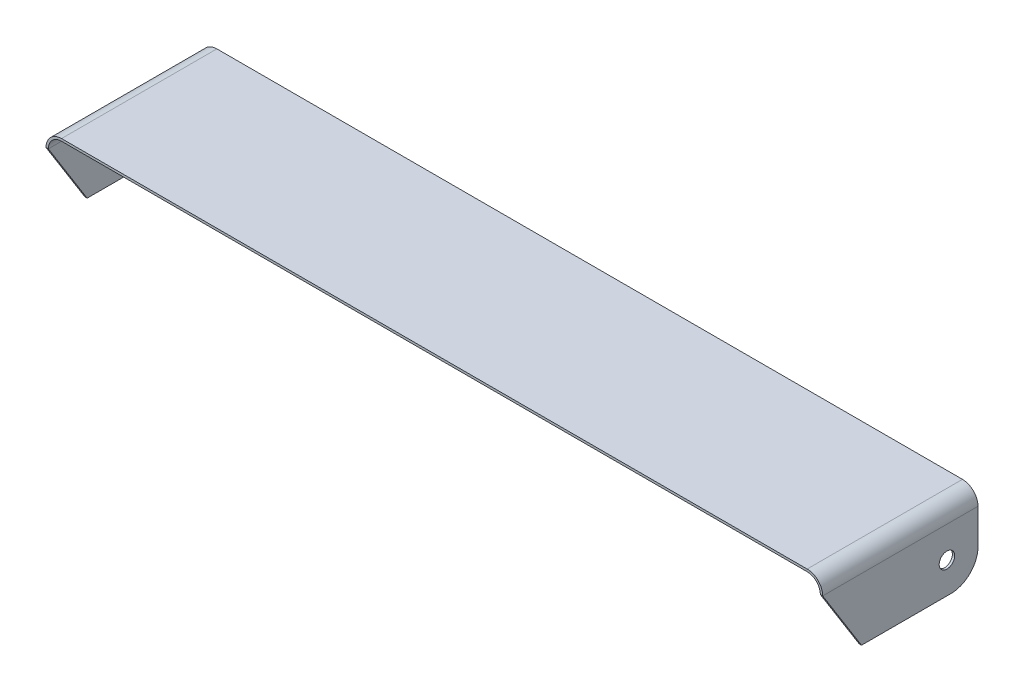
ISO-10303-21;
HEADER;
FILE_DESCRIPTION(('STEP AP214'),'2;1');
FILE_NAME('part.step','',(''),(''),'','','');
FILE_SCHEMA(('AUTOMOTIVE_DESIGN { 1 0 10303 214 1 1 1 1 }'));
ENDSEC;
DATA;
#1=APPLICATION_CONTEXT('core data for automotive mechanical design processes');
#2=APPLICATION_PROTOCOL_DEFINITION('international standard','automotive_design',2000,#1);
#3=PRODUCT_CONTEXT('',#1,'mechanical');
#4=PRODUCT('Part','Part','',(#3));
#5=PRODUCT_RELATED_PRODUCT_CATEGORY('part','',(#4));
#6=PRODUCT_DEFINITION_FORMATION('','',#4);
#7=PRODUCT_DEFINITION_CONTEXT('part definition',#1,'design');
#8=PRODUCT_DEFINITION('design','',#6,#7);
#9=PRODUCT_DEFINITION_SHAPE('','',#8);
#10=(LENGTH_UNIT() NAMED_UNIT(*) SI_UNIT(.MILLI.,.METRE.));
#11=(NAMED_UNIT(*) PLANE_ANGLE_UNIT() SI_UNIT($,.RADIAN.));
#12=(NAMED_UNIT(*) SI_UNIT($,.STERADIAN.) SOLID_ANGLE_UNIT());
#13=UNCERTAINTY_MEASURE_WITH_UNIT(LENGTH_MEASURE(1.E-05),#10,'distance_accuracy_value','');
#14=(GEOMETRIC_REPRESENTATION_CONTEXT(3) GLOBAL_UNCERTAINTY_ASSIGNED_CONTEXT((#13)) GLOBAL_UNIT_ASSIGNED_CONTEXT((#10,
#11,#12)) REPRESENTATION_CONTEXT('',''));
#15=CARTESIAN_POINT('',(0.,0.,0.));
#16=DIRECTION('',(0.,0.,1.));
#17=DIRECTION('',(1.,0.,0.));
#18=AXIS2_PLACEMENT_3D('',#15,#16,#17);
#19=CARTESIAN_POINT('',(-500.,0.,100.));
#20=DIRECTION('',(0.,1.,0.));
#21=DIRECTION('',(0.,0.,1.));
#22=AXIS2_PLACEMENT_3D('',#19,#20,#21);
#23=PLANE('',#22);
#24=DIRECTION('',(0.,0.,-1.));
#25=VECTOR('',#24,1.);
#26=CARTESIAN_POINT('',(-500.,0.,100.));
#27=LINE('',#26,#25);
#28=CARTESIAN_POINT('',(-500.,0.,50.));
#29=VERTEX_POINT('',#28);
#30=CARTESIAN_POINT('',(-500.,0.,-65.));
#31=VERTEX_POINT('',#30);
#32=EDGE_CURVE('E162',#29,#31,#27,.T.);
#33=ORIENTED_EDGE('',*,*,#32,.T.);
#34=DIRECTION('',(1.,0.,0.));
#35=VECTOR('',#34,1.);
#36=CARTESIAN_POINT('',(-500.,0.,-65.));
#37=LINE('',#36,#35);
#38=CARTESIAN_POINT('',(-497.,0.,-65.));
#39=VERTEX_POINT('',#38);
#40=EDGE_CURVE('E227',#31,#39,#37,.T.);
#41=ORIENTED_EDGE('',*,*,#40,.T.);
#42=DIRECTION('',(0.,0.,-1.));
#43=VECTOR('',#42,1.);
#44=CARTESIAN_POINT('',(-497.,0.,100.));
#45=LINE('',#44,#43);
#46=CARTESIAN_POINT('',(-497.,0.,50.));
#47=VERTEX_POINT('',#46);
#48=EDGE_CURVE('E220',#47,#39,#45,.T.);
#49=ORIENTED_EDGE('',*,*,#48,.F.);
#50=DIRECTION('',(1.,0.,0.));
#51=VECTOR('',#50,1.);
#52=CARTESIAN_POINT('',(-500.,0.,50.));
#53=LINE('',#52,#51);
#54=EDGE_CURVE('E273',#29,#47,#53,.T.);
#55=ORIENTED_EDGE('',*,*,#54,.F.);
#56=EDGE_LOOP('',(#33,#41,#49,#55));
#57=FACE_BOUND('',#56,.T.);
#58=ADVANCED_FACE('F39',(#57),#23,.F.);
#59=CARTESIAN_POINT('',(-497.,0.,100.));
#60=DIRECTION('',(-1.,0.,0.));
#61=DIRECTION('',(0.,0.,1.));
#62=AXIS2_PLACEMENT_3D('',#59,#60,#61);
#63=PLANE('',#62);
#64=CARTESIAN_POINT('',(-497.,40.,-60.));
#65=DIRECTION('',(-1.,0.,0.));
#66=DIRECTION('',(0.,0.,1.));
#67=AXIS2_PLACEMENT_3D('',#64,#65,#66);
#68=CIRCLE('',#67,10.);
#69=CARTESIAN_POINT('',(-497.,40.,-50.));
#70=VERTEX_POINT('',#69);
#71=EDGE_CURVE('E364',#70,#70,#68,.T.);
#72=ORIENTED_EDGE('',*,*,#71,.T.);
#73=EDGE_LOOP('',(#72));
#74=FACE_BOUND('',#73,.T.);
#75=ORIENTED_EDGE('',*,*,#48,.T.);
#76=CARTESIAN_POINT('',(-497.,35.,-65.));
#77=DIRECTION('',(-1.,0.,0.));
#78=DIRECTION('',(0.,0.,1.));
#79=AXIS2_PLACEMENT_3D('',#76,#77,#78);
#80=CIRCLE('',#79,35.);
#81=CARTESIAN_POINT('',(-497.,35.,-100.));
#82=VERTEX_POINT('',#81);
#83=EDGE_CURVE('E231',#39,#82,#80,.F.);
#84=ORIENTED_EDGE('',*,*,#83,.T.);
#85=DIRECTION('',(0.,1.,0.));
#86=VECTOR('',#85,1.);
#87=CARTESIAN_POINT('',(-497.,0.,-100.));
#88=LINE('',#87,#86);
#89=CARTESIAN_POINT('',(-497.,79.9999999999998,-100.));
#90=VERTEX_POINT('',#89);
#91=EDGE_CURVE('E320',#82,#90,#88,.T.);
#92=ORIENTED_EDGE('',*,*,#91,.T.);
#93=DIRECTION('',(0.,0.,-1.));
#94=VECTOR('',#93,1.);
#95=CARTESIAN_POINT('',(-497.,79.9999999999998,100.));
#96=LINE('',#95,#94);
#97=CARTESIAN_POINT('',(-497.,79.9999999999998,100.));
#98=VERTEX_POINT('',#97);
#99=EDGE_CURVE('E216',#98,#90,#96,.T.);
#100=ORIENTED_EDGE('',*,*,#99,.F.);
#101=DIRECTION('',(0.,-0.847998304005088,-0.52999894000318));
#102=VECTOR('',#101,1.);
#103=CARTESIAN_POINT('',(-497.,22.4719101123596,64.0449438202247));
#104=LINE('',#103,#102);
#105=EDGE_CURVE('E146',#98,#47,#104,.T.);
#106=ORIENTED_EDGE('',*,*,#105,.T.);
#107=EDGE_LOOP('',(#75,#84,#92,#100,#106));
#108=FACE_BOUND('',#107,.T.);
#109=ADVANCED_FACE('F335',(#74,#108),#63,.F.);
#110=CARTESIAN_POINT('',(-480.,80.,100.));
#111=DIRECTION('',(0.,0.,-1.));
#112=DIRECTION('',(-1.,0.,0.));
#113=AXIS2_PLACEMENT_3D('',#110,#111,#112);
#114=CYLINDRICAL_SURFACE('',#113,17.);
#115=CARTESIAN_POINT('',(-480.,80.,-100.));
#116=DIRECTION('',(0.,0.,-1.));
#117=DIRECTION('',(1.,0.,0.));
#118=AXIS2_PLACEMENT_3D('',#115,#116,#117);
#119=CIRCLE('',#118,17.);
#120=CARTESIAN_POINT('',(-480.,97.,-100.));
#121=VERTEX_POINT('',#120);
#122=EDGE_CURVE('E294',#90,#121,#119,.T.);
#123=ORIENTED_EDGE('',*,*,#122,.T.);
#124=DIRECTION('',(0.,0.,-1.));
#125=VECTOR('',#124,1.);
#126=CARTESIAN_POINT('',(-480.,97.,100.));
#127=LINE('',#126,#125);
#128=CARTESIAN_POINT('',(-480.,97.,100.));
#129=VERTEX_POINT('',#128);
#130=EDGE_CURVE('E212',#129,#121,#127,.T.);
#131=ORIENTED_EDGE('',*,*,#130,.F.);
#132=CARTESIAN_POINT('',(-480.,80.,100.));
#133=DIRECTION('',(0.,0.,-1.));
#134=DIRECTION('',(1.,0.,0.));
#135=AXIS2_PLACEMENT_3D('',#132,#133,#134);
#136=CIRCLE('',#135,17.);
#137=EDGE_CURVE('E306',#98,#129,#136,.T.);
#138=ORIENTED_EDGE('',*,*,#137,.F.);
#139=ORIENTED_EDGE('',*,*,#99,.T.);
#140=EDGE_LOOP('',(#123,#131,#138,#139));
#141=FACE_BOUND('',#140,.T.);
#142=ADVANCED_FACE('F325',(#141),#114,.F.);
#143=CARTESIAN_POINT('',(-480.,97.,100.));
#144=DIRECTION('',(0.,1.,0.));
#145=DIRECTION('',(-1.,0.,0.));
#146=AXIS2_PLACEMENT_3D('',#143,#144,#145);
#147=PLANE('',#146);
#148=DIRECTION('',(1.,0.,0.));
#149=VECTOR('',#148,1.);
#150=CARTESIAN_POINT('',(-480.,97.,-100.));
#151=LINE('',#150,#149);
#152=CARTESIAN_POINT('',(480.,97.,-100.));
#153=VERTEX_POINT('',#152);
#154=EDGE_CURVE('E289',#121,#153,#151,.T.);
#155=ORIENTED_EDGE('',*,*,#154,.T.);
#156=DIRECTION('',(0.,0.,-1.));
#157=VECTOR('',#156,1.);
#158=CARTESIAN_POINT('',(480.,97.,100.));
#159=LINE('',#158,#157);
#160=CARTESIAN_POINT('',(480.,97.,100.));
#161=VERTEX_POINT('',#160);
#162=EDGE_CURVE('E208',#161,#153,#159,.T.);
#163=ORIENTED_EDGE('',*,*,#162,.F.);
#164=DIRECTION('',(1.,0.,0.));
#165=VECTOR('',#164,1.);
#166=CARTESIAN_POINT('',(-480.,97.,100.));
#167=LINE('',#166,#165);
#168=EDGE_CURVE('E278',#129,#161,#167,.T.);
#169=ORIENTED_EDGE('',*,*,#168,.F.);
#170=ORIENTED_EDGE('',*,*,#130,.T.);
#171=EDGE_LOOP('',(#155,#163,#169,#170));
#172=FACE_BOUND('',#171,.T.);
#173=ADVANCED_FACE('F327',(#172),#147,.F.);
#174=CARTESIAN_POINT('',(480.,80.,100.));
#175=DIRECTION('',(0.,0.,-1.));
#176=DIRECTION('',(-1.,0.,0.));
#177=AXIS2_PLACEMENT_3D('',#174,#175,#176);
#178=CYLINDRICAL_SURFACE('',#177,17.);
#179=CARTESIAN_POINT('',(480.,80.,-100.));
#180=DIRECTION('',(0.,0.,-1.));
#181=DIRECTION('',(1.,0.,0.));
#182=AXIS2_PLACEMENT_3D('',#179,#180,#181);
#183=CIRCLE('',#182,17.);
#184=CARTESIAN_POINT('',(497.,79.9999999999999,-100.));
#185=VERTEX_POINT('',#184);
#186=EDGE_CURVE('E286',#153,#185,#183,.T.);
#187=ORIENTED_EDGE('',*,*,#186,.T.);
#188=DIRECTION('',(0.,0.,-1.));
#189=VECTOR('',#188,1.);
#190=CARTESIAN_POINT('',(497.,79.9999999999999,100.));
#191=LINE('',#190,#189);
#192=CARTESIAN_POINT('',(497.,80.,100.));
#193=VERTEX_POINT('',#192);
#194=EDGE_CURVE('E204',#193,#185,#191,.T.);
#195=ORIENTED_EDGE('',*,*,#194,.F.);
#196=CARTESIAN_POINT('',(480.,80.,100.));
#197=DIRECTION('',(0.,0.,-1.));
#198=DIRECTION('',(1.,0.,0.));
#199=AXIS2_PLACEMENT_3D('',#196,#197,#198);
#200=CIRCLE('',#199,17.);
#201=EDGE_CURVE('E276',#161,#193,#200,.T.);
#202=ORIENTED_EDGE('',*,*,#201,.F.);
#203=ORIENTED_EDGE('',*,*,#162,.T.);
#204=EDGE_LOOP('',(#187,#195,#202,#203));
#205=FACE_BOUND('',#204,.T.);
#206=ADVANCED_FACE('F284',(#205),#178,.F.);
#207=CARTESIAN_POINT('',(497.,79.9999999999999,100.));
#208=DIRECTION('',(1.,0.,0.));
#209=DIRECTION('',(0.,0.,-1.));
#210=AXIS2_PLACEMENT_3D('',#207,#208,#209);
#211=PLANE('',#210);
#212=CARTESIAN_POINT('',(497.,40.,-60.));
#213=DIRECTION('',(1.,0.,0.));
#214=DIRECTION('',(0.,0.,-1.));
#215=AXIS2_PLACEMENT_3D('',#212,#213,#214);
#216=CIRCLE('',#215,10.);
#217=CARTESIAN_POINT('',(497.,40.,-70.));
#218=VERTEX_POINT('',#217);
#219=EDGE_CURVE('E369',#218,#218,#216,.T.);
#220=ORIENTED_EDGE('',*,*,#219,.T.);
#221=EDGE_LOOP('',(#220));
#222=FACE_BOUND('',#221,.T.);
#223=DIRECTION('',(0.,-1.,0.));
#224=VECTOR('',#223,1.);
#225=CARTESIAN_POINT('',(497.,79.9999999999999,-100.));
#226=LINE('',#225,#224);
#227=CARTESIAN_POINT('',(497.,35.,-100.));
#228=VERTEX_POINT('',#227);
#229=EDGE_CURVE('E261',#185,#228,#226,.T.);
#230=ORIENTED_EDGE('',*,*,#229,.T.);
#231=CARTESIAN_POINT('',(497.,35.,-65.));
#232=DIRECTION('',(1.,0.,0.));
#233=DIRECTION('',(0.,0.,-1.));
#234=AXIS2_PLACEMENT_3D('',#231,#232,#233);
#235=CIRCLE('',#234,35.);
#236=CARTESIAN_POINT('',(497.,0.,-65.));
#237=VERTEX_POINT('',#236);
#238=EDGE_CURVE('E11',#228,#237,#235,.F.);
#239=ORIENTED_EDGE('',*,*,#238,.T.);
#240=DIRECTION('',(0.,0.,-1.));
#241=VECTOR('',#240,1.);
#242=CARTESIAN_POINT('',(497.,0.,100.));
#243=LINE('',#242,#241);
#244=CARTESIAN_POINT('',(497.,0.,50.));
#245=VERTEX_POINT('',#244);
#246=EDGE_CURVE('E201',#245,#237,#243,.T.);
#247=ORIENTED_EDGE('',*,*,#246,.F.);
#248=DIRECTION('',(0.,0.847998304005088,0.52999894000318));
#249=VECTOR('',#248,1.);
#250=CARTESIAN_POINT('',(497.,79.9999999999999,99.9999999999999));
#251=LINE('',#250,#249);
#252=EDGE_CURVE('E268',#245,#193,#251,.T.);
#253=ORIENTED_EDGE('',*,*,#252,.T.);
#254=ORIENTED_EDGE('',*,*,#194,.T.);
#255=EDGE_LOOP('',(#230,#239,#247,#253,#254));
#256=FACE_BOUND('',#255,.T.);
#257=ADVANCED_FACE('F267',(#222,#256),#211,.F.);
#258=CARTESIAN_POINT('',(497.,0.,100.));
#259=DIRECTION('',(0.,1.,0.));
#260=DIRECTION('',(0.,0.,1.));
#261=AXIS2_PLACEMENT_3D('',#258,#259,#260);
#262=PLANE('',#261);
#263=ORIENTED_EDGE('',*,*,#246,.T.);
#264=DIRECTION('',(1.,0.,0.));
#265=VECTOR('',#264,1.);
#266=CARTESIAN_POINT('',(497.,0.,-65.));
#267=LINE('',#266,#265);
#268=CARTESIAN_POINT('',(500.,0.,-65.));
#269=VERTEX_POINT('',#268);
#270=EDGE_CURVE('E243',#237,#269,#267,.T.);
#271=ORIENTED_EDGE('',*,*,#270,.T.);
#272=DIRECTION('',(0.,0.,-1.));
#273=VECTOR('',#272,1.);
#274=CARTESIAN_POINT('',(500.,0.,100.));
#275=LINE('',#274,#273);
#276=CARTESIAN_POINT('',(500.,0.,50.));
#277=VERTEX_POINT('',#276);
#278=EDGE_CURVE('E197',#277,#269,#275,.T.);
#279=ORIENTED_EDGE('',*,*,#278,.F.);
#280=EDGE_CURVE('E151',#245,#277,#53,.T.);
#281=ORIENTED_EDGE('',*,*,#280,.F.);
#282=EDGE_LOOP('',(#263,#271,#279,#281));
#283=FACE_BOUND('',#282,.T.);
#284=ADVANCED_FACE('F264',(#283),#262,.F.);
#285=CARTESIAN_POINT('',(500.,79.9999999999999,100.));
#286=DIRECTION('',(-1.,0.,0.));
#287=DIRECTION('',(0.,0.,1.));
#288=AXIS2_PLACEMENT_3D('',#285,#286,#287);
#289=PLANE('',#288);
#290=CARTESIAN_POINT('',(500.,40.,-60.));
#291=DIRECTION('',(1.,0.,0.));
#292=DIRECTION('',(0.,0.,-1.));
#293=AXIS2_PLACEMENT_3D('',#290,#291,#292);
#294=CIRCLE('',#293,10.);
#295=CARTESIAN_POINT('',(500.,40.,-70.));
#296=VERTEX_POINT('',#295);
#297=EDGE_CURVE('E374',#296,#296,#294,.T.);
#298=ORIENTED_EDGE('',*,*,#297,.F.);
#299=EDGE_LOOP('',(#298));
#300=FACE_BOUND('',#299,.T.);
#301=ORIENTED_EDGE('',*,*,#278,.T.);
#302=CARTESIAN_POINT('',(500.,35.,-65.));
#303=DIRECTION('',(-1.,0.,0.));
#304=DIRECTION('',(0.,0.,1.));
#305=AXIS2_PLACEMENT_3D('',#302,#303,#304);
#306=CIRCLE('',#305,35.);
#307=CARTESIAN_POINT('',(500.,35.,-100.));
#308=VERTEX_POINT('',#307);
#309=EDGE_CURVE('E48',#269,#308,#306,.F.);
#310=ORIENTED_EDGE('',*,*,#309,.T.);
#311=DIRECTION('',(0.,1.,0.));
#312=VECTOR('',#311,1.);
#313=CARTESIAN_POINT('',(500.,79.9999999999999,-100.));
#314=LINE('',#313,#312);
#315=CARTESIAN_POINT('',(500.,79.9999999999998,-100.));
#316=VERTEX_POINT('',#315);
#317=EDGE_CURVE('E250',#308,#316,#314,.T.);
#318=ORIENTED_EDGE('',*,*,#317,.T.);
#319=DIRECTION('',(0.,0.,-1.));
#320=VECTOR('',#319,1.);
#321=CARTESIAN_POINT('',(500.,79.9999999999998,100.));
#322=LINE('',#321,#320);
#323=CARTESIAN_POINT('',(500.,79.9999999999998,100.));
#324=VERTEX_POINT('',#323);
#325=EDGE_CURVE('E193',#324,#316,#322,.T.);
#326=ORIENTED_EDGE('',*,*,#325,.F.);
#327=DIRECTION('',(0.,0.847998304005088,0.52999894000318));
#328=VECTOR('',#327,1.);
#329=CARTESIAN_POINT('',(500.,0.,50.));
#330=LINE('',#329,#328);
#331=EDGE_CURVE('E164',#277,#324,#330,.T.);
#332=ORIENTED_EDGE('',*,*,#331,.F.);
#333=EDGE_LOOP('',(#301,#310,#318,#326,#332));
#334=FACE_BOUND('',#333,.T.);
#335=ADVANCED_FACE('F248',(#300,#334),#289,.F.);
#336=CARTESIAN_POINT('',(480.,80.,100.));
#337=DIRECTION('',(0.,0.,-1.));
#338=DIRECTION('',(-1.,0.,0.));
#339=AXIS2_PLACEMENT_3D('',#336,#337,#338);
#340=CYLINDRICAL_SURFACE('',#339,20.);
#341=CARTESIAN_POINT('',(480.,80.,-100.));
#342=DIRECTION('',(0.,0.,1.));
#343=DIRECTION('',(1.,0.,0.));
#344=AXIS2_PLACEMENT_3D('',#341,#342,#343);
#345=CIRCLE('',#344,20.);
#346=CARTESIAN_POINT('',(480.,100.,-100.));
#347=VERTEX_POINT('',#346);
#348=EDGE_CURVE('E259',#316,#347,#345,.T.);
#349=ORIENTED_EDGE('',*,*,#348,.T.);
#350=DIRECTION('',(0.,0.,-1.));
#351=VECTOR('',#350,1.);
#352=CARTESIAN_POINT('',(480.,100.,100.));
#353=LINE('',#352,#351);
#354=CARTESIAN_POINT('',(480.,100.,100.));
#355=VERTEX_POINT('',#354);
#356=EDGE_CURVE('E185',#355,#347,#353,.T.);
#357=ORIENTED_EDGE('',*,*,#356,.F.);
#358=CARTESIAN_POINT('',(480.,80.,100.));
#359=DIRECTION('',(0.,0.,1.));
#360=DIRECTION('',(1.,0.,0.));
#361=AXIS2_PLACEMENT_3D('',#358,#359,#360);
#362=CIRCLE('',#361,20.);
#363=EDGE_CURVE('E282',#324,#355,#362,.T.);
#364=ORIENTED_EDGE('',*,*,#363,.F.);
#365=ORIENTED_EDGE('',*,*,#325,.T.);
#366=EDGE_LOOP('',(#349,#357,#364,#365));
#367=FACE_BOUND('',#366,.T.);
#368=ADVANCED_FACE('F394',(#367),#340,.T.);
#369=CARTESIAN_POINT('',(-480.,100.,100.));
#370=DIRECTION('',(0.,-1.,0.));
#371=DIRECTION('',(0.,0.,-1.));
#372=AXIS2_PLACEMENT_3D('',#369,#370,#371);
#373=PLANE('',#372);
#374=DIRECTION('',(-1.,0.,0.));
#375=VECTOR('',#374,1.);
#376=CARTESIAN_POINT('',(-480.,100.,-100.));
#377=LINE('',#376,#375);
#378=CARTESIAN_POINT('',(-480.,100.,-100.));
#379=VERTEX_POINT('',#378);
#380=EDGE_CURVE('E300',#347,#379,#377,.T.);
#381=ORIENTED_EDGE('',*,*,#380,.T.);
#382=DIRECTION('',(0.,0.,-1.));
#383=VECTOR('',#382,1.);
#384=CARTESIAN_POINT('',(-480.,100.,100.));
#385=LINE('',#384,#383);
#386=CARTESIAN_POINT('',(-480.,100.,100.));
#387=VERTEX_POINT('',#386);
#388=EDGE_CURVE('E181',#387,#379,#385,.T.);
#389=ORIENTED_EDGE('',*,*,#388,.F.);
#390=DIRECTION('',(-1.,0.,0.));
#391=VECTOR('',#390,1.);
#392=CARTESIAN_POINT('',(-480.,100.,100.));
#393=LINE('',#392,#391);
#394=EDGE_CURVE('E171',#355,#387,#393,.T.);
#395=ORIENTED_EDGE('',*,*,#394,.F.);
#396=ORIENTED_EDGE('',*,*,#356,.T.);
#397=EDGE_LOOP('',(#381,#389,#395,#396));
#398=FACE_BOUND('',#397,.T.);
#399=ADVANCED_FACE('F390',(#398),#373,.F.);
#400=CARTESIAN_POINT('',(-480.,80.,100.));
#401=DIRECTION('',(0.,0.,-1.));
#402=DIRECTION('',(-1.,0.,0.));
#403=AXIS2_PLACEMENT_3D('',#400,#401,#402);
#404=CYLINDRICAL_SURFACE('',#403,20.);
#405=CARTESIAN_POINT('',(-480.,80.,-100.));
#406=DIRECTION('',(0.,0.,1.));
#407=DIRECTION('',(1.,0.,0.));
#408=AXIS2_PLACEMENT_3D('',#405,#406,#407);
#409=CIRCLE('',#408,20.);
#410=CARTESIAN_POINT('',(-500.,79.9999999999998,-100.));
#411=VERTEX_POINT('',#410);
#412=EDGE_CURVE('E179',#379,#411,#409,.T.);
#413=ORIENTED_EDGE('',*,*,#412,.T.);
#414=DIRECTION('',(0.,0.,-1.));
#415=VECTOR('',#414,1.);
#416=CARTESIAN_POINT('',(-500.,79.9999999999998,100.));
#417=LINE('',#416,#415);
#418=CARTESIAN_POINT('',(-500.,80.,100.));
#419=VERTEX_POINT('',#418);
#420=EDGE_CURVE('E159',#419,#411,#417,.T.);
#421=ORIENTED_EDGE('',*,*,#420,.F.);
#422=CARTESIAN_POINT('',(-480.,80.,100.));
#423=DIRECTION('',(0.,0.,1.));
#424=DIRECTION('',(1.,0.,0.));
#425=AXIS2_PLACEMENT_3D('',#422,#423,#424);
#426=CIRCLE('',#425,20.);
#427=EDGE_CURVE('E167',#387,#419,#426,.T.);
#428=ORIENTED_EDGE('',*,*,#427,.F.);
#429=ORIENTED_EDGE('',*,*,#388,.T.);
#430=EDGE_LOOP('',(#413,#421,#428,#429));
#431=FACE_BOUND('',#430,.T.);
#432=ADVANCED_FACE('F177',(#431),#404,.T.);
#433=CARTESIAN_POINT('',(-500.,0.,100.));
#434=DIRECTION('',(1.,0.,0.));
#435=DIRECTION('',(0.,1.,0.));
#436=AXIS2_PLACEMENT_3D('',#433,#434,#435);
#437=PLANE('',#436);
#438=CARTESIAN_POINT('',(-500.,40.,-60.));
#439=DIRECTION('',(1.,0.,0.));
#440=DIRECTION('',(0.,0.,-1.));
#441=AXIS2_PLACEMENT_3D('',#438,#439,#440);
#442=CIRCLE('',#441,10.);
#443=CARTESIAN_POINT('',(-500.,40.,-70.));
#444=VERTEX_POINT('',#443);
#445=EDGE_CURVE('E373',#444,#444,#442,.T.);
#446=ORIENTED_EDGE('',*,*,#445,.T.);
#447=EDGE_LOOP('',(#446));
#448=FACE_BOUND('',#447,.T.);
#449=DIRECTION('',(0.,-1.,0.));
#450=VECTOR('',#449,1.);
#451=CARTESIAN_POINT('',(-500.,0.,-100.));
#452=LINE('',#451,#450);
#453=CARTESIAN_POINT('',(-500.,35.,-100.));
#454=VERTEX_POINT('',#453);
#455=EDGE_CURVE('E304',#411,#454,#452,.T.);
#456=ORIENTED_EDGE('',*,*,#455,.T.);
#457=CARTESIAN_POINT('',(-500.,35.,-65.));
#458=DIRECTION('',(1.,0.,0.));
#459=DIRECTION('',(0.,1.,0.));
#460=AXIS2_PLACEMENT_3D('',#457,#458,#459);
#461=CIRCLE('',#460,35.);
#462=EDGE_CURVE('E240',#454,#31,#461,.F.);
#463=ORIENTED_EDGE('',*,*,#462,.T.);
#464=ORIENTED_EDGE('',*,*,#32,.F.);
#465=DIRECTION('',(0.,0.847998304005088,0.52999894000318));
#466=VECTOR('',#465,1.);
#467=CARTESIAN_POINT('',(-500.,0.,50.));
#468=LINE('',#467,#466);
#469=EDGE_CURVE('E143',#29,#419,#468,.T.);
#470=ORIENTED_EDGE('',*,*,#469,.T.);
#471=ORIENTED_EDGE('',*,*,#420,.T.);
#472=EDGE_LOOP('',(#456,#463,#464,#470,#471));
#473=FACE_BOUND('',#472,.T.);
#474=ADVANCED_FACE('F157',(#448,#473),#437,.F.);
#475=CARTESIAN_POINT('',(-480.,80.,100.));
#476=DIRECTION('',(0.,0.,1.));
#477=DIRECTION('',(1.,0.,0.));
#478=AXIS2_PLACEMENT_3D('',#475,#476,#477);
#479=PLANE('',#478);
#480=DIRECTION('',(-1.,0.,0.));
#481=VECTOR('',#480,1.);
#482=CARTESIAN_POINT('',(-480.,80.,100.));
#483=LINE('',#482,#481);
#484=EDGE_CURVE('E224',#324,#193,#483,.T.);
#485=ORIENTED_EDGE('',*,*,#484,.F.);
#486=ORIENTED_EDGE('',*,*,#363,.T.);
#487=ORIENTED_EDGE('',*,*,#394,.T.);
#488=ORIENTED_EDGE('',*,*,#427,.T.);
#489=DIRECTION('',(1.,0.,0.));
#490=VECTOR('',#489,1.);
#491=CARTESIAN_POINT('',(-500.,80.,100.));
#492=LINE('',#491,#490);
#493=EDGE_CURVE('E140',#419,#98,#492,.T.);
#494=ORIENTED_EDGE('',*,*,#493,.T.);
#495=ORIENTED_EDGE('',*,*,#137,.T.);
#496=ORIENTED_EDGE('',*,*,#168,.T.);
#497=ORIENTED_EDGE('',*,*,#201,.T.);
#498=EDGE_LOOP('',(#485,#486,#487,#488,#494,#495,#496,#497));
#499=FACE_BOUND('',#498,.T.);
#500=ADVANCED_FACE('F169',(#499),#479,.T.);
#501=CARTESIAN_POINT('',(-480.,80.,-100.));
#502=DIRECTION('',(0.,0.,1.));
#503=DIRECTION('',(1.,0.,0.));
#504=AXIS2_PLACEMENT_3D('',#501,#502,#503);
#505=PLANE('',#504);
#506=ORIENTED_EDGE('',*,*,#91,.F.);
#507=DIRECTION('',(1.,0.,0.));
#508=VECTOR('',#507,1.);
#509=CARTESIAN_POINT('',(-480.,35.,-100.));
#510=LINE('',#509,#508);
#511=EDGE_CURVE('E237',#82,#454,#510,.F.);
#512=ORIENTED_EDGE('',*,*,#511,.T.);
#513=ORIENTED_EDGE('',*,*,#455,.F.);
#514=ORIENTED_EDGE('',*,*,#412,.F.);
#515=ORIENTED_EDGE('',*,*,#380,.F.);
#516=ORIENTED_EDGE('',*,*,#348,.F.);
#517=ORIENTED_EDGE('',*,*,#317,.F.);
#518=DIRECTION('',(1.,0.,0.));
#519=VECTOR('',#518,1.);
#520=CARTESIAN_POINT('',(-480.,35.,-100.));
#521=LINE('',#520,#519);
#522=EDGE_CURVE('E234',#308,#228,#521,.F.);
#523=ORIENTED_EDGE('',*,*,#522,.T.);
#524=ORIENTED_EDGE('',*,*,#229,.F.);
#525=ORIENTED_EDGE('',*,*,#186,.F.);
#526=ORIENTED_EDGE('',*,*,#154,.F.);
#527=ORIENTED_EDGE('',*,*,#122,.F.);
#528=EDGE_LOOP('',(#506,#512,#513,#514,#515,#516,#517,#523,#524,#525,#526,#527));
#529=FACE_BOUND('',#528,.T.);
#530=ADVANCED_FACE('F256',(#529),#505,.F.);
#531=CARTESIAN_POINT('',(-500.,0.,50.));
#532=DIRECTION('',(0.,0.52999894000318,-0.847998304005088));
#533=DIRECTION('',(0.,0.847998304005088,0.52999894000318));
#534=AXIS2_PLACEMENT_3D('',#531,#532,#533);
#535=PLANE('',#534);
#536=ORIENTED_EDGE('',*,*,#493,.F.);
#537=ORIENTED_EDGE('',*,*,#469,.F.);
#538=ORIENTED_EDGE('',*,*,#54,.T.);
#539=ORIENTED_EDGE('',*,*,#105,.F.);
#540=EDGE_LOOP('',(#536,#537,#538,#539));
#541=FACE_BOUND('',#540,.T.);
#542=ADVANCED_FACE('F142',(#541),#535,.F.);
#543=ORIENTED_EDGE('',*,*,#280,.T.);
#544=ORIENTED_EDGE('',*,*,#331,.T.);
#545=ORIENTED_EDGE('',*,*,#484,.T.);
#546=ORIENTED_EDGE('',*,*,#252,.F.);
#547=EDGE_LOOP('',(#543,#544,#545,#546));
#548=FACE_BOUND('',#547,.T.);
#549=ADVANCED_FACE('F385',(#548),#535,.F.);
#550=CARTESIAN_POINT('',(-500.,40.,-60.));
#551=DIRECTION('',(1.,0.,0.));
#552=DIRECTION('',(0.,0.,-1.));
#553=AXIS2_PLACEMENT_3D('',#550,#551,#552);
#554=CYLINDRICAL_SURFACE('',#553,10.);
#555=ORIENTED_EDGE('',*,*,#445,.F.);
#556=EDGE_LOOP('',(#555));
#557=FACE_BOUND('',#556,.T.);
#558=ORIENTED_EDGE('',*,*,#71,.F.);
#559=EDGE_LOOP('',(#558));
#560=FACE_BOUND('',#559,.T.);
#561=ADVANCED_FACE('F353',(#557,#560),#554,.F.);
#562=ORIENTED_EDGE('',*,*,#297,.T.);
#563=EDGE_LOOP('',(#562));
#564=FACE_BOUND('',#563,.T.);
#565=ORIENTED_EDGE('',*,*,#219,.F.);
#566=EDGE_LOOP('',(#565));
#567=FACE_BOUND('',#566,.T.);
#568=ADVANCED_FACE('F347',(#564,#567),#554,.F.);
#569=CARTESIAN_POINT('',(-500.,35.,-65.));
#570=DIRECTION('',(1.,0.,0.));
#571=DIRECTION('',(0.,0.,-1.));
#572=AXIS2_PLACEMENT_3D('',#569,#570,#571);
#573=CYLINDRICAL_SURFACE('',#572,35.);
#574=ORIENTED_EDGE('',*,*,#462,.F.);
#575=ORIENTED_EDGE('',*,*,#511,.F.);
#576=ORIENTED_EDGE('',*,*,#83,.F.);
#577=ORIENTED_EDGE('',*,*,#40,.F.);
#578=EDGE_LOOP('',(#574,#575,#576,#577));
#579=FACE_BOUND('',#578,.T.);
#580=ADVANCED_FACE('F345',(#579),#573,.T.);
#581=CARTESIAN_POINT('',(497.,35.,-65.));
#582=DIRECTION('',(1.,0.,0.));
#583=DIRECTION('',(0.,0.,-1.));
#584=AXIS2_PLACEMENT_3D('',#581,#582,#583);
#585=CYLINDRICAL_SURFACE('',#584,35.);
#586=ORIENTED_EDGE('',*,*,#238,.F.);
#587=ORIENTED_EDGE('',*,*,#522,.F.);
#588=ORIENTED_EDGE('',*,*,#309,.F.);
#589=ORIENTED_EDGE('',*,*,#270,.F.);
#590=EDGE_LOOP('',(#586,#587,#588,#589));
#591=FACE_BOUND('',#590,.T.);
#592=ADVANCED_FACE('F41',(#591),#585,.T.);
#593=CLOSED_SHELL('',(#58,#109,#142,#173,#206,#257,#284,#335,#368,#399,#432,#474,#500,#530,#542,
#549,#561,#568,#580,#592));
#594=MANIFOLD_SOLID_BREP('B2',#593);
#595=ADVANCED_BREP_SHAPE_REPRESENTATION('',(#18,#594),#14);
#596=SHAPE_DEFINITION_REPRESENTATION(#9,#595);
ENDSEC;
END-ISO-10303-21;
